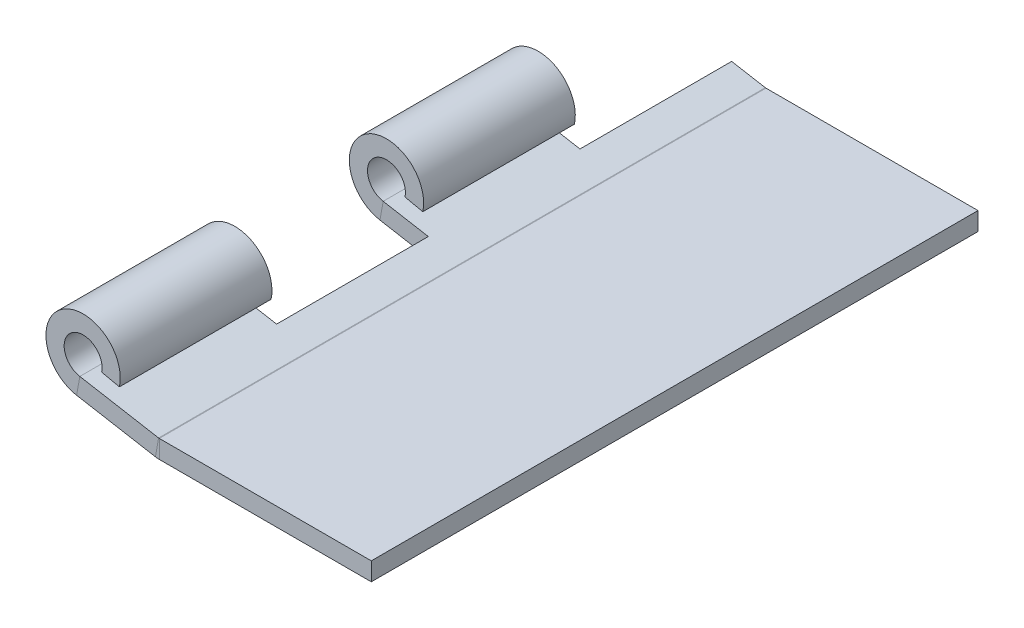
ISO-10303-21;
HEADER;
FILE_DESCRIPTION(('STEP AP214'),'2;1');
FILE_NAME('part.step','',(''),(''),'','','');
FILE_SCHEMA(('AUTOMOTIVE_DESIGN { 1 0 10303 214 1 1 1 1 }'));
ENDSEC;
DATA;
#1=APPLICATION_CONTEXT('core data for automotive mechanical design processes');
#2=APPLICATION_PROTOCOL_DEFINITION('international standard','automotive_design',2000,#1);
#3=PRODUCT_CONTEXT('',#1,'mechanical');
#4=PRODUCT('Part','Part','',(#3));
#5=PRODUCT_RELATED_PRODUCT_CATEGORY('part','',(#4));
#6=PRODUCT_DEFINITION_FORMATION('','',#4);
#7=PRODUCT_DEFINITION_CONTEXT('part definition',#1,'design');
#8=PRODUCT_DEFINITION('design','',#6,#7);
#9=PRODUCT_DEFINITION_SHAPE('','',#8);
#10=(LENGTH_UNIT() NAMED_UNIT(*) SI_UNIT(.MILLI.,.METRE.));
#11=(NAMED_UNIT(*) PLANE_ANGLE_UNIT() SI_UNIT($,.RADIAN.));
#12=(NAMED_UNIT(*) SI_UNIT($,.STERADIAN.) SOLID_ANGLE_UNIT());
#13=UNCERTAINTY_MEASURE_WITH_UNIT(LENGTH_MEASURE(1.E-05),#10,'distance_accuracy_value','');
#14=(GEOMETRIC_REPRESENTATION_CONTEXT(3) GLOBAL_UNCERTAINTY_ASSIGNED_CONTEXT((#13)) GLOBAL_UNIT_ASSIGNED_CONTEXT((#10,
#11,#12)) REPRESENTATION_CONTEXT('',''));
#15=CARTESIAN_POINT('',(0.,0.,0.));
#16=DIRECTION('',(0.,0.,1.));
#17=DIRECTION('',(1.,0.,0.));
#18=AXIS2_PLACEMENT_3D('',#15,#16,#17);
#19=CARTESIAN_POINT('',(-24.13,2.73166607386737,50.8));
#20=DIRECTION('',(0.,0.,-1.));
#21=DIRECTION('',(-1.,0.,0.));
#22=AXIS2_PLACEMENT_3D('',#19,#20,#21);
#23=CYLINDRICAL_SURFACE('',#22,1.5875);
#24=CARTESIAN_POINT('',(-24.13,2.73166607386737,12.7));
#25=DIRECTION('',(0.,0.,-1.));
#26=DIRECTION('',(-1.,0.,0.));
#27=AXIS2_PLACEMENT_3D('',#24,#25,#26);
#28=CIRCLE('',#27,1.5875);
#29=CARTESIAN_POINT('',(-22.5788955579043,2.3936849209744,12.7));
#30=VERTEX_POINT('',#29);
#31=CARTESIAN_POINT('',(-24.4056664820463,1.16828376596049,12.7));
#32=VERTEX_POINT('',#31);
#33=EDGE_CURVE('E192',#30,#32,#28,.F.);
#34=ORIENTED_EDGE('',*,*,#33,.F.);
#35=DIRECTION('',(0.,0.,-1.));
#36=VECTOR('',#35,1.);
#37=CARTESIAN_POINT('',(-22.5788955579043,2.3936849209744,50.8));
#38=LINE('',#37,#36);
#39=CARTESIAN_POINT('',(-22.5788955579043,2.39368492097438,25.4));
#40=VERTEX_POINT('',#39);
#41=EDGE_CURVE('E315',#40,#30,#38,.T.);
#42=ORIENTED_EDGE('',*,*,#41,.F.);
#43=CARTESIAN_POINT('',(-24.13,2.73166607386737,25.4));
#44=DIRECTION('',(0.,0.,-1.));
#45=DIRECTION('',(-1.,0.,0.));
#46=AXIS2_PLACEMENT_3D('',#43,#44,#45);
#47=CIRCLE('',#46,1.5875);
#48=CARTESIAN_POINT('',(-24.4056664820463,1.16828376596049,25.4));
#49=VERTEX_POINT('',#48);
#50=EDGE_CURVE('E233',#49,#40,#47,.T.);
#51=ORIENTED_EDGE('',*,*,#50,.F.);
#52=DIRECTION('',(0.,0.,-1.));
#53=VECTOR('',#52,1.);
#54=CARTESIAN_POINT('',(-24.4056664820463,1.16828376596049,50.8));
#55=LINE('',#54,#53);
#56=EDGE_CURVE('E270',#49,#32,#55,.T.);
#57=ORIENTED_EDGE('',*,*,#56,.T.);
#58=EDGE_LOOP('',(#34,#42,#51,#57));
#59=FACE_BOUND('',#58,.T.);
#60=ADVANCED_FACE('F39',(#59),#23,.F.);
#61=CARTESIAN_POINT('',(-21.0898352934923,2.06922301419715,50.8));
#62=DIRECTION('',(-0.212901513633368,-0.977073664312277,0.));
#63=DIRECTION('',(0.977073664312277,-0.212901513633368,0.));
#64=AXIS2_PLACEMENT_3D('',#61,#62,#63);
#65=PLANE('',#64);
#66=ORIENTED_EDGE('',*,*,#41,.T.);
#67=DIRECTION('',(0.977073664312274,-0.212901513633381,0.));
#68=VECTOR('',#67,1.);
#69=CARTESIAN_POINT('',(-21.0898352934924,2.06922301419711,12.7));
#70=LINE('',#69,#68);
#71=CARTESIAN_POINT('',(-21.0898352934923,2.06922301419715,12.7));
#72=VERTEX_POINT('',#71);
#73=EDGE_CURVE('E197',#30,#72,#70,.T.);
#74=ORIENTED_EDGE('',*,*,#73,.T.);
#75=DIRECTION('',(0.,0.,-1.));
#76=VECTOR('',#75,1.);
#77=CARTESIAN_POINT('',(-21.0898352934923,2.06922301419715,50.8));
#78=LINE('',#77,#76);
#79=CARTESIAN_POINT('',(-21.0898352934924,2.06922301419711,25.4));
#80=VERTEX_POINT('',#79);
#81=EDGE_CURVE('E311',#80,#72,#78,.T.);
#82=ORIENTED_EDGE('',*,*,#81,.F.);
#83=DIRECTION('',(0.977073664312275,-0.212901513633379,0.));
#84=VECTOR('',#83,1.);
#85=CARTESIAN_POINT('',(-21.0898352934924,2.06922301419711,25.4));
#86=LINE('',#85,#84);
#87=EDGE_CURVE('E235',#40,#80,#86,.T.);
#88=ORIENTED_EDGE('',*,*,#87,.F.);
#89=EDGE_LOOP('',(#66,#74,#82,#88));
#90=FACE_BOUND('',#89,.T.);
#91=ADVANCED_FACE('F381',(#90),#65,.T.);
#92=CARTESIAN_POINT('',(-24.13,2.73166607386737,50.8));
#93=DIRECTION('',(0.,0.,-1.));
#94=DIRECTION('',(-1.,0.,0.));
#95=AXIS2_PLACEMENT_3D('',#92,#93,#94);
#96=CYLINDRICAL_SURFACE('',#95,3.1115);
#97=ORIENTED_EDGE('',*,*,#81,.T.);
#98=CARTESIAN_POINT('',(-24.13,2.73166607386737,12.7));
#99=DIRECTION('',(0.,0.,1.));
#100=DIRECTION('',(1.,0.,0.));
#101=AXIS2_PLACEMENT_3D('',#98,#99,#100);
#102=CIRCLE('',#101,3.1115);
#103=CARTESIAN_POINT('',(-24.6703063048107,-0.332563249630114,12.7));
#104=VERTEX_POINT('',#103);
#105=EDGE_CURVE('E194',#72,#104,#102,.T.);
#106=ORIENTED_EDGE('',*,*,#105,.T.);
#107=DIRECTION('',(0.,0.,-1.));
#108=VECTOR('',#107,1.);
#109=CARTESIAN_POINT('',(-24.6703063048107,-0.332563249630114,50.8));
#110=LINE('',#109,#108);
#111=CARTESIAN_POINT('',(-24.6703063048107,-0.332563249630115,25.4));
#112=VERTEX_POINT('',#111);
#113=EDGE_CURVE('E307',#112,#104,#110,.T.);
#114=ORIENTED_EDGE('',*,*,#113,.F.);
#115=CARTESIAN_POINT('',(-24.13,2.73166607386737,25.4));
#116=DIRECTION('',(0.,0.,-1.));
#117=DIRECTION('',(-1.,0.,0.));
#118=AXIS2_PLACEMENT_3D('',#115,#116,#117);
#119=CIRCLE('',#118,3.1115);
#120=EDGE_CURVE('E237',#112,#80,#119,.T.);
#121=ORIENTED_EDGE('',*,*,#120,.T.);
#122=EDGE_LOOP('',(#97,#106,#114,#121));
#123=FACE_BOUND('',#122,.T.);
#124=ADVANCED_FACE('F388',(#123),#96,.T.);
#125=CARTESIAN_POINT('',(-18.0446398227644,-1.50084701559061,50.8));
#126=DIRECTION('',(-0.17364817766693,-0.984807753012208,0.));
#127=DIRECTION('',(0.984807753012208,-0.17364817766693,0.));
#128=AXIS2_PLACEMENT_3D('',#125,#126,#127);
#129=PLANE('',#128);
#130=DIRECTION('',(0.984807753012208,-0.17364817766693,0.));
#131=VECTOR('',#130,1.);
#132=CARTESIAN_POINT('',(-22.7809031524053,-0.6657160028348,12.7));
#133=LINE('',#132,#131);
#134=CARTESIAN_POINT('',(-20.8915,-0.998868756039487,12.7));
#135=VERTEX_POINT('',#134);
#136=EDGE_CURVE('E185',#135,#104,#133,.F.);
#137=ORIENTED_EDGE('',*,*,#136,.F.);
#138=DIRECTION('',(0.,0.,1.));
#139=VECTOR('',#138,1.);
#140=CARTESIAN_POINT('',(-20.8915,-0.998868756039488,6.35000000000002));
#141=LINE('',#140,#139);
#142=CARTESIAN_POINT('',(-20.8915,-0.998868756039488,0.));
#143=VERTEX_POINT('',#142);
#144=EDGE_CURVE('E177',#143,#135,#141,.T.);
#145=ORIENTED_EDGE('',*,*,#144,.F.);
#146=DIRECTION('',(-0.984807753012208,0.17364817766693,0.));
#147=VECTOR('',#146,1.);
#148=CARTESIAN_POINT('',(-18.0446398227644,-1.50084701559061,0.));
#149=LINE('',#148,#147);
#150=CARTESIAN_POINT('',(-18.0730896943338,-1.49583053563523,0.));
#151=VERTEX_POINT('',#150);
#152=EDGE_CURVE('E240',#151,#143,#149,.T.);
#153=ORIENTED_EDGE('',*,*,#152,.F.);
#154=DIRECTION('',(0.,0.,-1.));
#155=VECTOR('',#154,1.);
#156=CARTESIAN_POINT('',(-18.0730896943338,-1.49583053563523,50.8));
#157=LINE('',#156,#155);
#158=CARTESIAN_POINT('',(-18.0730896943338,-1.49583053563523,50.8));
#159=VERTEX_POINT('',#158);
#160=EDGE_CURVE('E304',#159,#151,#157,.T.);
#161=ORIENTED_EDGE('',*,*,#160,.F.);
#162=DIRECTION('',(-0.984807753012208,0.17364817766693,0.));
#163=VECTOR('',#162,1.);
#164=CARTESIAN_POINT('',(-18.0446398227644,-1.50084701559061,50.8));
#165=LINE('',#164,#163);
#166=CARTESIAN_POINT('',(-24.6703063048107,-0.332563249630114,50.8));
#167=VERTEX_POINT('',#166);
#168=EDGE_CURVE('E249',#159,#167,#165,.T.);
#169=ORIENTED_EDGE('',*,*,#168,.T.);
#170=CARTESIAN_POINT('',(-24.6703063048107,-0.332563249630115,38.1));
#171=VERTEX_POINT('',#170);
#172=EDGE_CURVE('E308',#167,#171,#110,.T.);
#173=ORIENTED_EDGE('',*,*,#172,.T.);
#174=DIRECTION('',(-0.984807753012208,0.17364817766693,0.));
#175=VECTOR('',#174,1.);
#176=CARTESIAN_POINT('',(-18.0446398227644,-1.50084701559061,38.1));
#177=LINE('',#176,#175);
#178=CARTESIAN_POINT('',(-20.8915,-0.998868756039487,38.1));
#179=VERTEX_POINT('',#178);
#180=EDGE_CURVE('E213',#179,#171,#177,.T.);
#181=ORIENTED_EDGE('',*,*,#180,.F.);
#182=DIRECTION('',(0.,0.,1.));
#183=VECTOR('',#182,1.);
#184=CARTESIAN_POINT('',(-20.8915,-0.998868756039487,50.8));
#185=LINE('',#184,#183);
#186=CARTESIAN_POINT('',(-20.8915,-0.998868756039488,25.4));
#187=VERTEX_POINT('',#186);
#188=EDGE_CURVE('E202',#187,#179,#185,.T.);
#189=ORIENTED_EDGE('',*,*,#188,.F.);
#190=DIRECTION('',(0.984807753012208,-0.17364817766693,0.));
#191=VECTOR('',#190,1.);
#192=CARTESIAN_POINT('',(-18.0446398227644,-1.50084701559061,25.4));
#193=LINE('',#192,#191);
#194=EDGE_CURVE('E221',#112,#187,#193,.T.);
#195=ORIENTED_EDGE('',*,*,#194,.F.);
#196=ORIENTED_EDGE('',*,*,#113,.T.);
#197=EDGE_LOOP('',(#137,#145,#153,#161,#169,#173,#181,#189,#195,#196));
#198=FACE_BOUND('',#197,.T.);
#199=ADVANCED_FACE('F360',(#198),#129,.T.);
#200=CARTESIAN_POINT('',(-17.78,0.,50.8));
#201=DIRECTION('',(-0.17364817766693,-0.984807753012208,0.));
#202=DIRECTION('',(0.984807753012208,-0.17364817766693,0.));
#203=AXIS2_PLACEMENT_3D('',#200,#201,#202);
#204=PLANE('',#203);
#205=DIRECTION('',(0.,0.,1.));
#206=VECTOR('',#205,1.);
#207=CARTESIAN_POINT('',(-20.6268601772356,0.50197825955112,50.8));
#208=LINE('',#207,#206);
#209=CARTESIAN_POINT('',(-20.6268601772356,0.501978259551117,0.));
#210=VERTEX_POINT('',#209);
#211=CARTESIAN_POINT('',(-20.6268601772356,0.501978259551118,12.7));
#212=VERTEX_POINT('',#211);
#213=EDGE_CURVE('E54',#210,#212,#208,.T.);
#214=ORIENTED_EDGE('',*,*,#213,.T.);
#215=DIRECTION('',(-0.984807753012208,0.17364817766693,0.));
#216=VECTOR('',#215,1.);
#217=CARTESIAN_POINT('',(-17.78,0.,12.7));
#218=LINE('',#217,#216);
#219=EDGE_CURVE('E165',#212,#32,#218,.T.);
#220=ORIENTED_EDGE('',*,*,#219,.T.);
#221=ORIENTED_EDGE('',*,*,#56,.F.);
#222=DIRECTION('',(0.984807753012208,-0.17364817766693,0.));
#223=VECTOR('',#222,1.);
#224=CARTESIAN_POINT('',(-17.78,0.,25.4));
#225=LINE('',#224,#223);
#226=CARTESIAN_POINT('',(-20.6268601772356,0.501978259551117,25.4));
#227=VERTEX_POINT('',#226);
#228=EDGE_CURVE('E216',#49,#227,#225,.T.);
#229=ORIENTED_EDGE('',*,*,#228,.T.);
#230=DIRECTION('',(0.,0.,1.));
#231=VECTOR('',#230,1.);
#232=CARTESIAN_POINT('',(-20.6268601772356,0.501978259551117,50.8));
#233=LINE('',#232,#231);
#234=CARTESIAN_POINT('',(-20.6268601772356,0.501978259551118,38.1));
#235=VERTEX_POINT('',#234);
#236=EDGE_CURVE('E207',#227,#235,#233,.T.);
#237=ORIENTED_EDGE('',*,*,#236,.T.);
#238=DIRECTION('',(0.984807753012208,-0.17364817766693,0.));
#239=VECTOR('',#238,1.);
#240=CARTESIAN_POINT('',(-17.78,0.,38.1));
#241=LINE('',#240,#239);
#242=CARTESIAN_POINT('',(-24.4056664820463,1.16828376596049,38.1));
#243=VERTEX_POINT('',#242);
#244=EDGE_CURVE('E62',#235,#243,#241,.F.);
#245=ORIENTED_EDGE('',*,*,#244,.T.);
#246=CARTESIAN_POINT('',(-24.4056664820463,1.16828376596049,50.8));
#247=VERTEX_POINT('',#246);
#248=EDGE_CURVE('E289',#247,#243,#55,.T.);
#249=ORIENTED_EDGE('',*,*,#248,.F.);
#250=DIRECTION('',(-0.984807753012208,0.17364817766693,0.));
#251=VECTOR('',#250,1.);
#252=CARTESIAN_POINT('',(-17.78,0.,50.8));
#253=LINE('',#252,#251);
#254=CARTESIAN_POINT('',(-17.8084498715694,0.00501647995537797,50.8));
#255=VERTEX_POINT('',#254);
#256=EDGE_CURVE('E267',#255,#247,#253,.T.);
#257=ORIENTED_EDGE('',*,*,#256,.F.);
#258=DIRECTION('',(0.,0.,-1.));
#259=VECTOR('',#258,1.);
#260=CARTESIAN_POINT('',(-17.8084498715694,0.00501647995537797,50.8));
#261=LINE('',#260,#259);
#262=CARTESIAN_POINT('',(-17.8084498715694,0.00501647995537797,0.));
#263=VERTEX_POINT('',#262);
#264=EDGE_CURVE('E292',#255,#263,#261,.T.);
#265=ORIENTED_EDGE('',*,*,#264,.T.);
#266=DIRECTION('',(-0.984807753012208,0.17364817766693,0.));
#267=VECTOR('',#266,1.);
#268=CARTESIAN_POINT('',(-17.78,0.,0.));
#269=LINE('',#268,#267);
#270=EDGE_CURVE('E184',#263,#210,#269,.T.);
#271=ORIENTED_EDGE('',*,*,#270,.T.);
#272=EDGE_LOOP('',(#214,#220,#221,#229,#237,#245,#249,#257,#265,#271));
#273=FACE_BOUND('',#272,.T.);
#274=ADVANCED_FACE('F181',(#273),#204,.F.);
#275=CARTESIAN_POINT('',(-17.7511112433038,-1.524,0.));
#276=DIRECTION('',(0.,0.,-1.));
#277=DIRECTION('',(-1.,0.,0.));
#278=AXIS2_PLACEMENT_3D('',#275,#276,#277);
#279=PLANE('',#278);
#280=ORIENTED_EDGE('',*,*,#152,.T.);
#281=DIRECTION('',(-0.17364817766693,-0.984807753012208,0.));
#282=VECTOR('',#281,1.);
#283=CARTESIAN_POINT('',(-20.6268601772356,0.501978259551117,0.));
#284=LINE('',#283,#282);
#285=EDGE_CURVE('E178',#143,#210,#284,.F.);
#286=ORIENTED_EDGE('',*,*,#285,.T.);
#287=ORIENTED_EDGE('',*,*,#270,.F.);
#288=DIRECTION('',(-0.173648177666931,-0.984807753012208,0.));
#289=VECTOR('',#288,1.);
#290=CARTESIAN_POINT('',(-17.8084498715694,0.00501647995537797,0.));
#291=LINE('',#290,#289);
#292=EDGE_CURVE('E321',#263,#151,#291,.T.);
#293=ORIENTED_EDGE('',*,*,#292,.T.);
#294=EDGE_LOOP('',(#280,#286,#287,#293));
#295=FACE_BOUND('',#294,.T.);
#296=ADVANCED_FACE('F395',(#295),#279,.T.);
#297=CARTESIAN_POINT('',(-24.13,2.73166607386737,38.1));
#298=DIRECTION('',(0.,0.,-1.));
#299=DIRECTION('',(-1.,0.,0.));
#300=AXIS2_PLACEMENT_3D('',#297,#298,#299);
#301=CIRCLE('',#300,1.5875);
#302=CARTESIAN_POINT('',(-22.5788955579043,2.39368492097438,38.1));
#303=VERTEX_POINT('',#302);
#304=EDGE_CURVE('E227',#303,#243,#301,.F.);
#305=ORIENTED_EDGE('',*,*,#304,.F.);
#306=CARTESIAN_POINT('',(-22.5788955579043,2.3936849209744,50.8));
#307=VERTEX_POINT('',#306);
#308=EDGE_CURVE('E316',#307,#303,#38,.T.);
#309=ORIENTED_EDGE('',*,*,#308,.F.);
#310=CARTESIAN_POINT('',(-24.13,2.73166607386737,50.8));
#311=DIRECTION('',(0.,0.,-1.));
#312=DIRECTION('',(-1.,0.,0.));
#313=AXIS2_PLACEMENT_3D('',#310,#311,#312);
#314=CIRCLE('',#313,1.5875);
#315=EDGE_CURVE('E241',#247,#307,#314,.T.);
#316=ORIENTED_EDGE('',*,*,#315,.F.);
#317=ORIENTED_EDGE('',*,*,#248,.T.);
#318=EDGE_LOOP('',(#305,#309,#316,#317));
#319=FACE_BOUND('',#318,.T.);
#320=ADVANCED_FACE('F384',(#319),#23,.F.);
#321=ORIENTED_EDGE('',*,*,#308,.T.);
#322=DIRECTION('',(0.977073664312275,-0.212901513633379,0.));
#323=VECTOR('',#322,1.);
#324=CARTESIAN_POINT('',(-21.0898352934924,2.06922301419711,38.1));
#325=LINE('',#324,#323);
#326=CARTESIAN_POINT('',(-21.0898352934924,2.06922301419711,38.1));
#327=VERTEX_POINT('',#326);
#328=EDGE_CURVE('E224',#303,#327,#325,.T.);
#329=ORIENTED_EDGE('',*,*,#328,.T.);
#330=CARTESIAN_POINT('',(-21.0898352934923,2.06922301419715,50.8));
#331=VERTEX_POINT('',#330);
#332=EDGE_CURVE('E312',#331,#327,#78,.T.);
#333=ORIENTED_EDGE('',*,*,#332,.F.);
#334=DIRECTION('',(-0.977073664312277,0.212901513633368,0.));
#335=VECTOR('',#334,1.);
#336=CARTESIAN_POINT('',(-21.0898352934923,2.06922301419715,50.8));
#337=LINE('',#336,#335);
#338=EDGE_CURVE('E243',#331,#307,#337,.T.);
#339=ORIENTED_EDGE('',*,*,#338,.T.);
#340=EDGE_LOOP('',(#321,#329,#333,#339));
#341=FACE_BOUND('',#340,.T.);
#342=ADVANCED_FACE('F391',(#341),#65,.T.);
#343=ORIENTED_EDGE('',*,*,#332,.T.);
#344=CARTESIAN_POINT('',(-24.13,2.73166607386737,38.1));
#345=DIRECTION('',(0.,0.,1.));
#346=DIRECTION('',(1.,0.,0.));
#347=AXIS2_PLACEMENT_3D('',#344,#345,#346);
#348=CIRCLE('',#347,3.1115);
#349=EDGE_CURVE('E230',#327,#171,#348,.T.);
#350=ORIENTED_EDGE('',*,*,#349,.T.);
#351=ORIENTED_EDGE('',*,*,#172,.F.);
#352=CARTESIAN_POINT('',(-24.13,2.73166607386737,50.8));
#353=DIRECTION('',(0.,0.,1.));
#354=DIRECTION('',(1.,0.,0.));
#355=AXIS2_PLACEMENT_3D('',#352,#353,#354);
#356=CIRCLE('',#355,3.1115);
#357=EDGE_CURVE('E246',#167,#331,#356,.F.);
#358=ORIENTED_EDGE('',*,*,#357,.T.);
#359=EDGE_LOOP('',(#343,#350,#351,#358));
#360=FACE_BOUND('',#359,.T.);
#361=ADVANCED_FACE('F401',(#360),#96,.T.);
#362=CARTESIAN_POINT('',(-24.4056664820463,1.16828376596049,50.8));
#363=DIRECTION('',(0.,0.,1.));
#364=DIRECTION('',(1.,0.,0.));
#365=AXIS2_PLACEMENT_3D('',#362,#363,#364);
#366=PLANE('',#365);
#367=DIRECTION('',(-0.17364817766693,-0.984807753012208,0.));
#368=VECTOR('',#367,1.);
#369=CARTESIAN_POINT('',(-24.4056664820463,1.16828376596049,50.8));
#370=LINE('',#369,#368);
#371=EDGE_CURVE('E11',#247,#167,#370,.T.);
#372=ORIENTED_EDGE('',*,*,#371,.F.);
#373=ORIENTED_EDGE('',*,*,#315,.T.);
#374=ORIENTED_EDGE('',*,*,#338,.F.);
#375=ORIENTED_EDGE('',*,*,#357,.F.);
#376=EDGE_LOOP('',(#372,#373,#374,#375));
#377=FACE_BOUND('',#376,.T.);
#378=ADVANCED_FACE('F41',(#377),#366,.T.);
#379=CARTESIAN_POINT('',(-17.7511112433038,0.,50.8));
#380=DIRECTION('',(0.,0.,1.));
#381=DIRECTION('',(1.,0.,0.));
#382=AXIS2_PLACEMENT_3D('',#379,#380,#381);
#383=PLANE('',#382);
#384=DIRECTION('',(0.,-1.,0.));
#385=VECTOR('',#384,1.);
#386=CARTESIAN_POINT('',(-17.7511112433038,0.,50.8));
#387=LINE('',#386,#385);
#388=CARTESIAN_POINT('',(-17.7511112433038,0.,50.8));
#389=VERTEX_POINT('',#388);
#390=CARTESIAN_POINT('',(-17.7511112433038,-1.524,50.8));
#391=VERTEX_POINT('',#390);
#392=EDGE_CURVE('E47',#389,#391,#387,.T.);
#393=ORIENTED_EDGE('',*,*,#392,.F.);
#394=CARTESIAN_POINT('',(-17.7511112433038,0.330200000000003,50.8));
#395=DIRECTION('',(0.,0.,1.));
#396=DIRECTION('',(1.,0.,0.));
#397=AXIS2_PLACEMENT_3D('',#394,#395,#396);
#398=CIRCLE('',#397,0.3302);
#399=EDGE_CURVE('E264',#389,#255,#398,.F.);
#400=ORIENTED_EDGE('',*,*,#399,.T.);
#401=DIRECTION('',(0.173648177666931,0.984807753012208,0.));
#402=VECTOR('',#401,1.);
#403=CARTESIAN_POINT('',(-18.0730896943338,-1.49583053563523,50.8));
#404=LINE('',#403,#402);
#405=EDGE_CURVE('E323',#159,#255,#404,.T.);
#406=ORIENTED_EDGE('',*,*,#405,.F.);
#407=CARTESIAN_POINT('',(-17.7511112433038,0.330200000000003,50.8));
#408=DIRECTION('',(0.,0.,1.));
#409=DIRECTION('',(1.,0.,0.));
#410=AXIS2_PLACEMENT_3D('',#407,#408,#409);
#411=CIRCLE('',#410,1.8542);
#412=EDGE_CURVE('E252',#391,#159,#411,.F.);
#413=ORIENTED_EDGE('',*,*,#412,.F.);
#414=EDGE_LOOP('',(#393,#400,#406,#413));
#415=FACE_BOUND('',#414,.T.);
#416=ADVANCED_FACE('F338',(#415),#383,.T.);
#417=CARTESIAN_POINT('',(-18.0730896943338,-1.49583053563523,50.8));
#418=DIRECTION('',(0.,0.,1.));
#419=DIRECTION('',(1.,0.,0.));
#420=AXIS2_PLACEMENT_3D('',#417,#418,#419);
#421=PLANE('',#420);
#422=DIRECTION('',(-1.,0.,0.));
#423=VECTOR('',#422,1.);
#424=CARTESIAN_POINT('',(0.,0.,50.8));
#425=LINE('',#424,#423);
#426=CARTESIAN_POINT('',(0.,0.,50.8));
#427=VERTEX_POINT('',#426);
#428=EDGE_CURVE('E261',#427,#389,#425,.T.);
#429=ORIENTED_EDGE('',*,*,#428,.T.);
#430=ORIENTED_EDGE('',*,*,#392,.T.);
#431=DIRECTION('',(-1.,0.,0.));
#432=VECTOR('',#431,1.);
#433=CARTESIAN_POINT('',(0.,-1.524,50.8));
#434=LINE('',#433,#432);
#435=CARTESIAN_POINT('',(0.,-1.524,50.8));
#436=VERTEX_POINT('',#435);
#437=EDGE_CURVE('E255',#436,#391,#434,.T.);
#438=ORIENTED_EDGE('',*,*,#437,.F.);
#439=DIRECTION('',(0.,-1.,0.));
#440=VECTOR('',#439,1.);
#441=CARTESIAN_POINT('',(0.,0.,50.8));
#442=LINE('',#441,#440);
#443=EDGE_CURVE('E258',#427,#436,#442,.T.);
#444=ORIENTED_EDGE('',*,*,#443,.F.);
#445=EDGE_LOOP('',(#429,#430,#438,#444));
#446=FACE_BOUND('',#445,.T.);
#447=ADVANCED_FACE('F327',(#446),#421,.T.);
#448=CARTESIAN_POINT('',(-17.8084498715694,0.00501647995537797,0.));
#449=DIRECTION('',(0.,0.,-1.));
#450=DIRECTION('',(-1.,0.,0.));
#451=AXIS2_PLACEMENT_3D('',#448,#449,#450);
#452=PLANE('',#451);
#453=ORIENTED_EDGE('',*,*,#292,.F.);
#454=CARTESIAN_POINT('',(-17.7511112433038,0.330200000000003,0.));
#455=DIRECTION('',(0.,0.,1.));
#456=DIRECTION('',(1.,0.,0.));
#457=AXIS2_PLACEMENT_3D('',#454,#455,#456);
#458=CIRCLE('',#457,0.3302);
#459=CARTESIAN_POINT('',(-17.7511112433038,0.,0.));
#460=VERTEX_POINT('',#459);
#461=EDGE_CURVE('E285',#460,#263,#458,.F.);
#462=ORIENTED_EDGE('',*,*,#461,.F.);
#463=DIRECTION('',(0.,1.,0.));
#464=VECTOR('',#463,1.);
#465=CARTESIAN_POINT('',(-17.7511112433038,-1.524,0.));
#466=LINE('',#465,#464);
#467=CARTESIAN_POINT('',(-17.7511112433038,-1.524,0.));
#468=VERTEX_POINT('',#467);
#469=EDGE_CURVE('E319',#468,#460,#466,.T.);
#470=ORIENTED_EDGE('',*,*,#469,.F.);
#471=CARTESIAN_POINT('',(-17.7511112433038,0.330200000000003,0.));
#472=DIRECTION('',(0.,0.,1.));
#473=DIRECTION('',(1.,0.,0.));
#474=AXIS2_PLACEMENT_3D('',#471,#472,#473);
#475=CIRCLE('',#474,1.8542);
#476=EDGE_CURVE('E273',#468,#151,#475,.F.);
#477=ORIENTED_EDGE('',*,*,#476,.T.);
#478=EDGE_LOOP('',(#453,#462,#470,#477));
#479=FACE_BOUND('',#478,.T.);
#480=ADVANCED_FACE('F365',(#479),#452,.T.);
#481=CARTESIAN_POINT('',(-17.7511112433038,0.330200000000003,50.8));
#482=DIRECTION('',(0.,0.,-1.));
#483=DIRECTION('',(-1.,0.,0.));
#484=AXIS2_PLACEMENT_3D('',#481,#482,#483);
#485=CYLINDRICAL_SURFACE('',#484,1.8542);
#486=ORIENTED_EDGE('',*,*,#476,.F.);
#487=DIRECTION('',(0.,0.,-1.));
#488=VECTOR('',#487,1.);
#489=CARTESIAN_POINT('',(-17.7511112433038,-1.524,50.8));
#490=LINE('',#489,#488);
#491=EDGE_CURVE('E301',#391,#468,#490,.T.);
#492=ORIENTED_EDGE('',*,*,#491,.F.);
#493=ORIENTED_EDGE('',*,*,#412,.T.);
#494=ORIENTED_EDGE('',*,*,#160,.T.);
#495=EDGE_LOOP('',(#486,#492,#493,#494));
#496=FACE_BOUND('',#495,.T.);
#497=ADVANCED_FACE('F335',(#496),#485,.T.);
#498=CARTESIAN_POINT('',(0.,-1.524,50.8));
#499=DIRECTION('',(0.,-1.,0.));
#500=DIRECTION('',(1.,0.,0.));
#501=AXIS2_PLACEMENT_3D('',#498,#499,#500);
#502=PLANE('',#501);
#503=DIRECTION('',(-1.,0.,0.));
#504=VECTOR('',#503,1.);
#505=CARTESIAN_POINT('',(0.,-1.524,0.));
#506=LINE('',#505,#504);
#507=CARTESIAN_POINT('',(0.,-1.524,0.));
#508=VERTEX_POINT('',#507);
#509=EDGE_CURVE('E276',#508,#468,#506,.T.);
#510=ORIENTED_EDGE('',*,*,#509,.F.);
#511=DIRECTION('',(0.,0.,-1.));
#512=VECTOR('',#511,1.);
#513=CARTESIAN_POINT('',(0.,-1.524,50.8));
#514=LINE('',#513,#512);
#515=EDGE_CURVE('E299',#436,#508,#514,.T.);
#516=ORIENTED_EDGE('',*,*,#515,.F.);
#517=ORIENTED_EDGE('',*,*,#437,.T.);
#518=ORIENTED_EDGE('',*,*,#491,.T.);
#519=EDGE_LOOP('',(#510,#516,#517,#518));
#520=FACE_BOUND('',#519,.T.);
#521=ADVANCED_FACE('F340',(#520),#502,.T.);
#522=CARTESIAN_POINT('',(0.,0.,50.8));
#523=DIRECTION('',(1.,0.,0.));
#524=DIRECTION('',(0.,1.,0.));
#525=AXIS2_PLACEMENT_3D('',#522,#523,#524);
#526=PLANE('',#525);
#527=DIRECTION('',(0.,-1.,0.));
#528=VECTOR('',#527,1.);
#529=CARTESIAN_POINT('',(0.,0.,0.));
#530=LINE('',#529,#528);
#531=CARTESIAN_POINT('',(0.,0.,0.));
#532=VERTEX_POINT('',#531);
#533=EDGE_CURVE('E279',#532,#508,#530,.T.);
#534=ORIENTED_EDGE('',*,*,#533,.F.);
#535=DIRECTION('',(0.,0.,-1.));
#536=VECTOR('',#535,1.);
#537=CARTESIAN_POINT('',(0.,0.,50.8));
#538=LINE('',#537,#536);
#539=EDGE_CURVE('E297',#427,#532,#538,.T.);
#540=ORIENTED_EDGE('',*,*,#539,.F.);
#541=ORIENTED_EDGE('',*,*,#443,.T.);
#542=ORIENTED_EDGE('',*,*,#515,.T.);
#543=EDGE_LOOP('',(#534,#540,#541,#542));
#544=FACE_BOUND('',#543,.T.);
#545=ADVANCED_FACE('F343',(#544),#526,.T.);
#546=CARTESIAN_POINT('',(0.,0.,50.8));
#547=DIRECTION('',(0.,-1.,0.));
#548=DIRECTION('',(1.,0.,0.));
#549=AXIS2_PLACEMENT_3D('',#546,#547,#548);
#550=PLANE('',#549);
#551=DIRECTION('',(-1.,0.,0.));
#552=VECTOR('',#551,1.);
#553=CARTESIAN_POINT('',(0.,0.,0.));
#554=LINE('',#553,#552);
#555=EDGE_CURVE('E282',#532,#460,#554,.T.);
#556=ORIENTED_EDGE('',*,*,#555,.T.);
#557=DIRECTION('',(0.,0.,-1.));
#558=VECTOR('',#557,1.);
#559=CARTESIAN_POINT('',(-17.7511112433038,0.,50.8));
#560=LINE('',#559,#558);
#561=EDGE_CURVE('E294',#389,#460,#560,.T.);
#562=ORIENTED_EDGE('',*,*,#561,.F.);
#563=ORIENTED_EDGE('',*,*,#428,.F.);
#564=ORIENTED_EDGE('',*,*,#539,.T.);
#565=EDGE_LOOP('',(#556,#562,#563,#564));
#566=FACE_BOUND('',#565,.T.);
#567=ADVANCED_FACE('F346',(#566),#550,.F.);
#568=CARTESIAN_POINT('',(-17.7511112433038,0.330200000000003,50.8));
#569=DIRECTION('',(0.,0.,-1.));
#570=DIRECTION('',(-1.,0.,0.));
#571=AXIS2_PLACEMENT_3D('',#568,#569,#570);
#572=CYLINDRICAL_SURFACE('',#571,0.3302);
#573=ORIENTED_EDGE('',*,*,#461,.T.);
#574=ORIENTED_EDGE('',*,*,#264,.F.);
#575=ORIENTED_EDGE('',*,*,#399,.F.);
#576=ORIENTED_EDGE('',*,*,#561,.T.);
#577=EDGE_LOOP('',(#573,#574,#575,#576));
#578=FACE_BOUND('',#577,.T.);
#579=ADVANCED_FACE('F351',(#578),#572,.F.);
#580=CARTESIAN_POINT('',(-24.13,2.73166607386737,50.8));
#581=DIRECTION('',(0.,0.,-1.));
#582=DIRECTION('',(-1.,0.,0.));
#583=AXIS2_PLACEMENT_3D('',#580,#581,#582);
#584=PLANE('',#583);
#585=ORIENTED_EDGE('',*,*,#256,.T.);
#586=ORIENTED_EDGE('',*,*,#371,.T.);
#587=ORIENTED_EDGE('',*,*,#168,.F.);
#588=ORIENTED_EDGE('',*,*,#405,.T.);
#589=EDGE_LOOP('',(#585,#586,#587,#588));
#590=FACE_BOUND('',#589,.T.);
#591=ADVANCED_FACE('F356',(#590),#584,.F.);
#592=CARTESIAN_POINT('',(-24.13,2.73166607386737,0.));
#593=DIRECTION('',(0.,0.,-1.));
#594=DIRECTION('',(-1.,0.,0.));
#595=AXIS2_PLACEMENT_3D('',#592,#593,#594);
#596=PLANE('',#595);
#597=ORIENTED_EDGE('',*,*,#509,.T.);
#598=ORIENTED_EDGE('',*,*,#469,.T.);
#599=ORIENTED_EDGE('',*,*,#555,.F.);
#600=ORIENTED_EDGE('',*,*,#533,.T.);
#601=EDGE_LOOP('',(#597,#598,#599,#600));
#602=FACE_BOUND('',#601,.T.);
#603=ADVANCED_FACE('F367',(#602),#596,.T.);
#604=CARTESIAN_POINT('',(-24.13,2.73166607386737,25.4));
#605=DIRECTION('',(0.,0.,1.));
#606=DIRECTION('',(1.,0.,0.));
#607=AXIS2_PLACEMENT_3D('',#604,#605,#606);
#608=PLANE('',#607);
#609=DIRECTION('',(0.17364817766693,0.984807753012208,0.));
#610=VECTOR('',#609,1.);
#611=CARTESIAN_POINT('',(-24.6703063048107,-0.332563249630115,25.4));
#612=LINE('',#611,#610);
#613=EDGE_CURVE('E219',#112,#49,#612,.T.);
#614=ORIENTED_EDGE('',*,*,#613,.T.);
#615=ORIENTED_EDGE('',*,*,#50,.T.);
#616=ORIENTED_EDGE('',*,*,#87,.T.);
#617=ORIENTED_EDGE('',*,*,#120,.F.);
#618=EDGE_LOOP('',(#614,#615,#616,#617));
#619=FACE_BOUND('',#618,.T.);
#620=ADVANCED_FACE('F369',(#619),#608,.T.);
#621=CARTESIAN_POINT('',(-24.13,2.73166607386737,38.1));
#622=DIRECTION('',(0.,0.,-1.));
#623=DIRECTION('',(-1.,0.,0.));
#624=AXIS2_PLACEMENT_3D('',#621,#622,#623);
#625=PLANE('',#624);
#626=ORIENTED_EDGE('',*,*,#328,.F.);
#627=ORIENTED_EDGE('',*,*,#304,.T.);
#628=DIRECTION('',(0.17364817766693,0.984807753012208,0.));
#629=VECTOR('',#628,1.);
#630=CARTESIAN_POINT('',(-24.6703063048107,-0.332563249630115,38.1));
#631=LINE('',#630,#629);
#632=EDGE_CURVE('E210',#171,#243,#631,.T.);
#633=ORIENTED_EDGE('',*,*,#632,.F.);
#634=ORIENTED_EDGE('',*,*,#349,.F.);
#635=EDGE_LOOP('',(#626,#627,#633,#634));
#636=FACE_BOUND('',#635,.T.);
#637=ADVANCED_FACE('F375',(#636),#625,.T.);
#638=CARTESIAN_POINT('',(-18.0446398227644,-1.50084701559061,25.4));
#639=DIRECTION('',(0.,0.,-1.));
#640=DIRECTION('',(0.984807753012208,-0.17364817766693,0.));
#641=AXIS2_PLACEMENT_3D('',#638,#639,#640);
#642=PLANE('',#641);
#643=ORIENTED_EDGE('',*,*,#228,.F.);
#644=ORIENTED_EDGE('',*,*,#613,.F.);
#645=ORIENTED_EDGE('',*,*,#194,.T.);
#646=DIRECTION('',(-0.17364817766693,-0.984807753012208,0.));
#647=VECTOR('',#646,1.);
#648=CARTESIAN_POINT('',(-20.8915,-0.998868756039488,25.4));
#649=LINE('',#648,#647);
#650=EDGE_CURVE('E200',#187,#227,#649,.F.);
#651=ORIENTED_EDGE('',*,*,#650,.T.);
#652=EDGE_LOOP('',(#643,#644,#645,#651));
#653=FACE_BOUND('',#652,.T.);
#654=ADVANCED_FACE('F420',(#653),#642,.F.);
#655=CARTESIAN_POINT('',(-18.0446398227644,-1.50084701559061,38.1));
#656=DIRECTION('',(0.,0.,1.));
#657=DIRECTION('',(-0.984807753012208,0.17364817766693,0.));
#658=AXIS2_PLACEMENT_3D('',#655,#656,#657);
#659=PLANE('',#658);
#660=ORIENTED_EDGE('',*,*,#632,.T.);
#661=ORIENTED_EDGE('',*,*,#244,.F.);
#662=DIRECTION('',(-0.17364817766693,-0.984807753012208,0.));
#663=VECTOR('',#662,1.);
#664=CARTESIAN_POINT('',(-20.8915,-0.998868756039487,38.1));
#665=LINE('',#664,#663);
#666=EDGE_CURVE('E205',#179,#235,#665,.F.);
#667=ORIENTED_EDGE('',*,*,#666,.F.);
#668=ORIENTED_EDGE('',*,*,#180,.T.);
#669=EDGE_LOOP('',(#660,#661,#667,#668));
#670=FACE_BOUND('',#669,.T.);
#671=ADVANCED_FACE('F410',(#670),#659,.F.);
#672=CARTESIAN_POINT('',(-20.8915,-0.998868756039487,50.8));
#673=DIRECTION('',(0.984807753012208,-0.17364817766693,0.));
#674=DIRECTION('',(0.,0.,1.));
#675=AXIS2_PLACEMENT_3D('',#672,#673,#674);
#676=PLANE('',#675);
#677=ORIENTED_EDGE('',*,*,#650,.F.);
#678=ORIENTED_EDGE('',*,*,#188,.T.);
#679=ORIENTED_EDGE('',*,*,#666,.T.);
#680=ORIENTED_EDGE('',*,*,#236,.F.);
#681=EDGE_LOOP('',(#677,#678,#679,#680));
#682=FACE_BOUND('',#681,.T.);
#683=ADVANCED_FACE('F416',(#682),#676,.F.);
#684=CARTESIAN_POINT('',(-24.13,2.73166607386737,12.7));
#685=DIRECTION('',(0.,0.,-1.));
#686=DIRECTION('',(-1.,0.,0.));
#687=AXIS2_PLACEMENT_3D('',#684,#685,#686);
#688=PLANE('',#687);
#689=ORIENTED_EDGE('',*,*,#33,.T.);
#690=DIRECTION('',(-0.17364817766693,-0.984807753012208,0.));
#691=VECTOR('',#690,1.);
#692=CARTESIAN_POINT('',(-24.4056664820463,1.16828376596049,12.7));
#693=LINE('',#692,#691);
#694=EDGE_CURVE('E170',#32,#104,#693,.T.);
#695=ORIENTED_EDGE('',*,*,#694,.T.);
#696=ORIENTED_EDGE('',*,*,#105,.F.);
#697=ORIENTED_EDGE('',*,*,#73,.F.);
#698=EDGE_LOOP('',(#689,#695,#696,#697));
#699=FACE_BOUND('',#698,.T.);
#700=ADVANCED_FACE('F430',(#699),#688,.T.);
#701=CARTESIAN_POINT('',(-20.6268601772356,0.50197825955112,50.8));
#702=DIRECTION('',(0.984807753012208,-0.17364817766693,0.));
#703=DIRECTION('',(0.,0.,1.));
#704=AXIS2_PLACEMENT_3D('',#701,#702,#703);
#705=PLANE('',#704);
#706=ORIENTED_EDGE('',*,*,#285,.F.);
#707=ORIENTED_EDGE('',*,*,#144,.T.);
#708=DIRECTION('',(-0.17364817766693,-0.984807753012208,0.));
#709=VECTOR('',#708,1.);
#710=CARTESIAN_POINT('',(-20.6268601772356,0.501978259551118,12.7));
#711=LINE('',#710,#709);
#712=EDGE_CURVE('E167',#135,#212,#711,.F.);
#713=ORIENTED_EDGE('',*,*,#712,.T.);
#714=ORIENTED_EDGE('',*,*,#213,.F.);
#715=EDGE_LOOP('',(#706,#707,#713,#714));
#716=FACE_BOUND('',#715,.T.);
#717=ADVANCED_FACE('F175',(#716),#705,.F.);
#718=CARTESIAN_POINT('',(-17.78,0.,12.7));
#719=DIRECTION('',(0.,0.,1.));
#720=DIRECTION('',(-0.984807753012208,0.17364817766693,0.));
#721=AXIS2_PLACEMENT_3D('',#718,#719,#720);
#722=PLANE('',#721);
#723=ORIENTED_EDGE('',*,*,#136,.T.);
#724=ORIENTED_EDGE('',*,*,#694,.F.);
#725=ORIENTED_EDGE('',*,*,#219,.F.);
#726=ORIENTED_EDGE('',*,*,#712,.F.);
#727=EDGE_LOOP('',(#723,#724,#725,#726));
#728=FACE_BOUND('',#727,.T.);
#729=ADVANCED_FACE('F166',(#728),#722,.F.);
#730=CLOSED_SHELL('',(#60,#91,#124,#199,#274,#296,#320,#342,#361,#378,#416,#447,#480,#497,#521,
#545,#567,#579,#591,#603,#620,#637,#654,#671,#683,#700,#717,#729));
#731=MANIFOLD_SOLID_BREP('B2',#730);
#732=ADVANCED_BREP_SHAPE_REPRESENTATION('',(#18,#731),#14);
#733=SHAPE_DEFINITION_REPRESENTATION(#9,#732);
ENDSEC;
END-ISO-10303-21;
